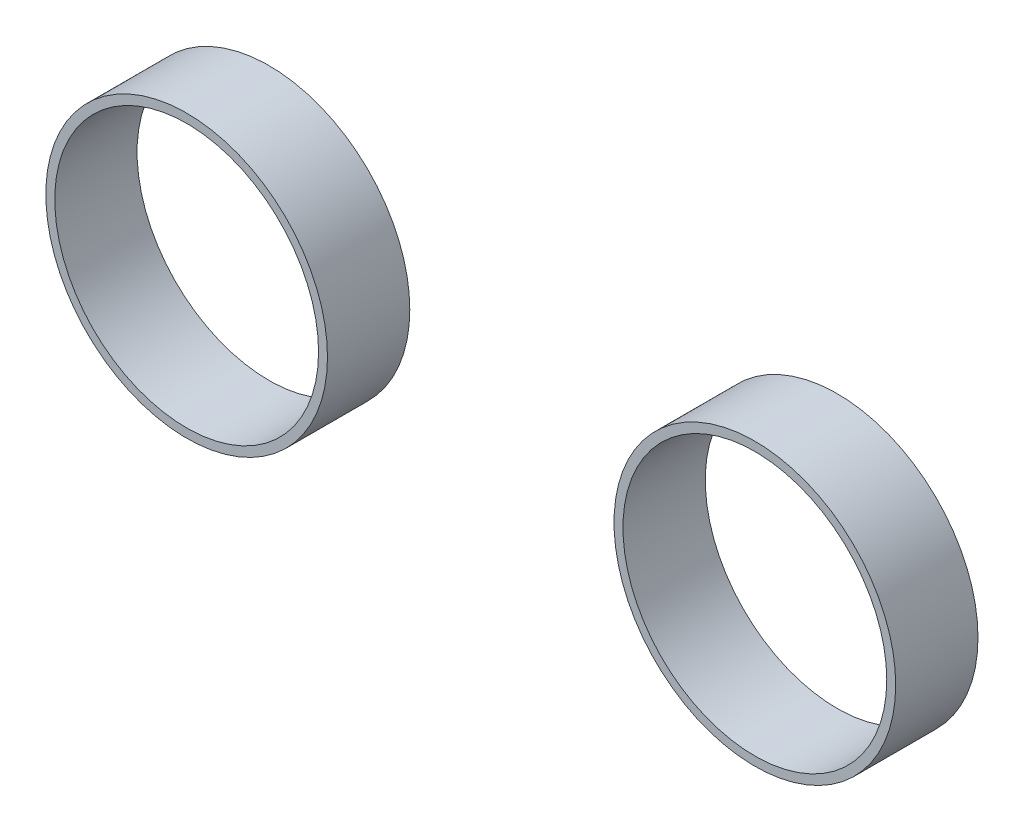
ISO-10303-21;
HEADER;
FILE_DESCRIPTION(('STEP AP214'),'2;1');
FILE_NAME('part.step','',(''),(''),'','','');
FILE_SCHEMA(('AUTOMOTIVE_DESIGN { 1 0 10303 214 1 1 1 1 }'));
ENDSEC;
DATA;
#1=APPLICATION_CONTEXT('core data for automotive mechanical design processes');
#2=APPLICATION_PROTOCOL_DEFINITION('international standard','automotive_design',2000,#1);
#3=PRODUCT_CONTEXT('',#1,'mechanical');
#4=PRODUCT('Part','Part','',(#3));
#5=PRODUCT_RELATED_PRODUCT_CATEGORY('part','',(#4));
#6=PRODUCT_DEFINITION_FORMATION('','',#4);
#7=PRODUCT_DEFINITION_CONTEXT('part definition',#1,'design');
#8=PRODUCT_DEFINITION('design','',#6,#7);
#9=PRODUCT_DEFINITION_SHAPE('','',#8);
#10=(LENGTH_UNIT() NAMED_UNIT(*) SI_UNIT(.MILLI.,.METRE.));
#11=(NAMED_UNIT(*) PLANE_ANGLE_UNIT() SI_UNIT($,.RADIAN.));
#12=(NAMED_UNIT(*) SI_UNIT($,.STERADIAN.) SOLID_ANGLE_UNIT());
#13=UNCERTAINTY_MEASURE_WITH_UNIT(LENGTH_MEASURE(1.E-05),#10,'distance_accuracy_value','');
#14=(GEOMETRIC_REPRESENTATION_CONTEXT(3) GLOBAL_UNCERTAINTY_ASSIGNED_CONTEXT((#13)) GLOBAL_UNIT_ASSIGNED_CONTEXT((#10,
#11,#12)) REPRESENTATION_CONTEXT('',''));
#15=CARTESIAN_POINT('',(0.,0.,0.));
#16=DIRECTION('',(0.,0.,1.));
#17=DIRECTION('',(1.,0.,0.));
#18=AXIS2_PLACEMENT_3D('',#15,#16,#17);
#19=CARTESIAN_POINT('',(1435.9804727587,-423.382336201578,-40.56));
#20=DIRECTION('',(0.,0.,1.));
#21=DIRECTION('',(1.,0.,0.));
#22=AXIS2_PLACEMENT_3D('',#19,#20,#21);
#23=CYLINDRICAL_SURFACE('',#22,69.3999999999999);
#24=CARTESIAN_POINT('',(1435.9804727587,-423.382336201578,-40.56));
#25=DIRECTION('',(0.,0.,1.));
#26=DIRECTION('',(1.,0.,0.));
#27=AXIS2_PLACEMENT_3D('',#24,#25,#26);
#28=CIRCLE('',#27,69.3999999999999);
#29=CARTESIAN_POINT('',(1505.3804727587,-423.382336201578,-40.56));
#30=VERTEX_POINT('',#29);
#31=EDGE_CURVE('E58',#30,#30,#28,.T.);
#32=ORIENTED_EDGE('',*,*,#31,.T.);
#33=EDGE_LOOP('',(#32));
#34=FACE_BOUND('',#33,.T.);
#35=CARTESIAN_POINT('',(1435.9804727587,-423.382336201578,0.));
#36=DIRECTION('',(0.,0.,1.));
#37=DIRECTION('',(1.,0.,0.));
#38=AXIS2_PLACEMENT_3D('',#35,#36,#37);
#39=CIRCLE('',#38,69.3999999999999);
#40=CARTESIAN_POINT('',(1505.3804727587,-423.382336201578,0.));
#41=VERTEX_POINT('',#40);
#42=EDGE_CURVE('E56',#41,#41,#39,.T.);
#43=ORIENTED_EDGE('',*,*,#42,.F.);
#44=EDGE_LOOP('',(#43));
#45=FACE_BOUND('',#44,.T.);
#46=ADVANCED_FACE('F45',(#34,#45),#23,.T.);
#47=CARTESIAN_POINT('',(1435.9804727587,-423.382336201578,-40.56));
#48=DIRECTION('',(0.,0.,1.));
#49=DIRECTION('',(1.,0.,0.));
#50=AXIS2_PLACEMENT_3D('',#47,#48,#49);
#51=PLANE('',#50);
#52=CARTESIAN_POINT('',(1435.9804727587,-423.382336201578,-40.56));
#53=DIRECTION('',(0.,0.,1.));
#54=DIRECTION('',(1.,0.,0.));
#55=AXIS2_PLACEMENT_3D('',#52,#53,#54);
#56=CIRCLE('',#55,64.9999999999999);
#57=CARTESIAN_POINT('',(1500.9804727587,-423.382336201578,-40.56));
#58=VERTEX_POINT('',#57);
#59=EDGE_CURVE('E49',#58,#58,#56,.T.);
#60=ORIENTED_EDGE('',*,*,#59,.T.);
#61=EDGE_LOOP('',(#60));
#62=FACE_BOUND('',#61,.T.);
#63=ORIENTED_EDGE('',*,*,#31,.F.);
#64=EDGE_LOOP('',(#63));
#65=FACE_BOUND('',#64,.T.);
#66=ADVANCED_FACE('F67',(#62,#65),#51,.F.);
#67=CARTESIAN_POINT('',(1435.9804727587,-423.382336201578,0.));
#68=DIRECTION('',(0.,0.,1.));
#69=DIRECTION('',(1.,0.,0.));
#70=AXIS2_PLACEMENT_3D('',#67,#68,#69);
#71=PLANE('',#70);
#72=CARTESIAN_POINT('',(1435.9804727587,-423.382336201578,0.));
#73=DIRECTION('',(0.,0.,1.));
#74=DIRECTION('',(1.,0.,0.));
#75=AXIS2_PLACEMENT_3D('',#72,#73,#74);
#76=CIRCLE('',#75,64.9999999999999);
#77=CARTESIAN_POINT('',(1500.9804727587,-423.382336201578,0.));
#78=VERTEX_POINT('',#77);
#79=EDGE_CURVE('E11',#78,#78,#76,.T.);
#80=ORIENTED_EDGE('',*,*,#79,.F.);
#81=EDGE_LOOP('',(#80));
#82=FACE_BOUND('',#81,.T.);
#83=ORIENTED_EDGE('',*,*,#42,.T.);
#84=EDGE_LOOP('',(#83));
#85=FACE_BOUND('',#84,.T.);
#86=ADVANCED_FACE('F64',(#82,#85),#71,.T.);
#87=CARTESIAN_POINT('',(1435.9804727587,-423.382336201578,-40.56));
#88=DIRECTION('',(0.,0.,1.));
#89=DIRECTION('',(1.,0.,0.));
#90=AXIS2_PLACEMENT_3D('',#87,#88,#89);
#91=CYLINDRICAL_SURFACE('',#90,64.9999999999999);
#92=ORIENTED_EDGE('',*,*,#59,.F.);
#93=EDGE_LOOP('',(#92));
#94=FACE_BOUND('',#93,.T.);
#95=ORIENTED_EDGE('',*,*,#79,.T.);
#96=EDGE_LOOP('',(#95));
#97=FACE_BOUND('',#96,.T.);
#98=ADVANCED_FACE('F47',(#94,#97),#91,.F.);
#99=CLOSED_SHELL('',(#46,#66,#86,#98));
#100=MANIFOLD_SOLID_BREP('B2',#99);
#101=CARTESIAN_POINT('',(1715.9804727587,-423.382336201567,-40.56));
#102=DIRECTION('',(0.,0.,1.));
#103=DIRECTION('',(1.,0.,0.));
#104=AXIS2_PLACEMENT_3D('',#101,#102,#103);
#105=CYLINDRICAL_SURFACE('',#104,69.3999999999999);
#106=CARTESIAN_POINT('',(1715.9804727587,-423.382336201567,-40.56));
#107=DIRECTION('',(0.,0.,1.));
#108=DIRECTION('',(1.,0.,0.));
#109=AXIS2_PLACEMENT_3D('',#106,#107,#108);
#110=CIRCLE('',#109,69.3999999999999);
#111=CARTESIAN_POINT('',(1785.3804727587,-423.382336201567,-40.56));
#112=VERTEX_POINT('',#111);
#113=EDGE_CURVE('E44',#112,#112,#110,.T.);
#114=ORIENTED_EDGE('',*,*,#113,.T.);
#115=EDGE_LOOP('',(#114));
#116=FACE_BOUND('',#115,.T.);
#117=CARTESIAN_POINT('',(1715.9804727587,-423.382336201567,0.));
#118=DIRECTION('',(0.,0.,1.));
#119=DIRECTION('',(1.,0.,0.));
#120=AXIS2_PLACEMENT_3D('',#117,#118,#119);
#121=CIRCLE('',#120,69.3999999999999);
#122=CARTESIAN_POINT('',(1785.3804727587,-423.382336201567,0.));
#123=VERTEX_POINT('',#122);
#124=EDGE_CURVE('E110',#123,#123,#121,.T.);
#125=ORIENTED_EDGE('',*,*,#124,.F.);
#126=EDGE_LOOP('',(#125));
#127=FACE_BOUND('',#126,.T.);
#128=ADVANCED_FACE('F107',(#116,#127),#105,.T.);
#129=CARTESIAN_POINT('',(1715.9804727587,-423.382336201567,-40.56));
#130=DIRECTION('',(0.,0.,1.));
#131=DIRECTION('',(1.,0.,0.));
#132=AXIS2_PLACEMENT_3D('',#129,#130,#131);
#133=PLANE('',#132);
#134=CARTESIAN_POINT('',(1715.9804727587,-423.382336201567,-40.56));
#135=DIRECTION('',(0.,0.,1.));
#136=DIRECTION('',(1.,0.,0.));
#137=AXIS2_PLACEMENT_3D('',#134,#135,#136);
#138=CIRCLE('',#137,64.9999999999999);
#139=CARTESIAN_POINT('',(1780.9804727587,-423.382336201567,-40.56));
#140=VERTEX_POINT('',#139);
#141=EDGE_CURVE('E117',#140,#140,#138,.T.);
#142=ORIENTED_EDGE('',*,*,#141,.T.);
#143=EDGE_LOOP('',(#142));
#144=FACE_BOUND('',#143,.T.);
#145=ORIENTED_EDGE('',*,*,#113,.F.);
#146=EDGE_LOOP('',(#145));
#147=FACE_BOUND('',#146,.T.);
#148=ADVANCED_FACE('F125',(#144,#147),#133,.F.);
#149=CARTESIAN_POINT('',(1715.9804727587,-423.382336201567,0.));
#150=DIRECTION('',(0.,0.,1.));
#151=DIRECTION('',(1.,0.,0.));
#152=AXIS2_PLACEMENT_3D('',#149,#150,#151);
#153=PLANE('',#152);
#154=CARTESIAN_POINT('',(1715.9804727587,-423.382336201567,0.));
#155=DIRECTION('',(0.,0.,1.));
#156=DIRECTION('',(1.,0.,0.));
#157=AXIS2_PLACEMENT_3D('',#154,#155,#156);
#158=CIRCLE('',#157,64.9999999999999);
#159=CARTESIAN_POINT('',(1780.9804727587,-423.382336201567,0.));
#160=VERTEX_POINT('',#159);
#161=EDGE_CURVE('E119',#160,#160,#158,.T.);
#162=ORIENTED_EDGE('',*,*,#161,.F.);
#163=EDGE_LOOP('',(#162));
#164=FACE_BOUND('',#163,.T.);
#165=ORIENTED_EDGE('',*,*,#124,.T.);
#166=EDGE_LOOP('',(#165));
#167=FACE_BOUND('',#166,.T.);
#168=ADVANCED_FACE('F131',(#164,#167),#153,.T.);
#169=CARTESIAN_POINT('',(1715.9804727587,-423.382336201567,-40.56));
#170=DIRECTION('',(0.,0.,1.));
#171=DIRECTION('',(1.,0.,0.));
#172=AXIS2_PLACEMENT_3D('',#169,#170,#171);
#173=CYLINDRICAL_SURFACE('',#172,64.9999999999999);
#174=ORIENTED_EDGE('',*,*,#141,.F.);
#175=EDGE_LOOP('',(#174));
#176=FACE_BOUND('',#175,.T.);
#177=ORIENTED_EDGE('',*,*,#161,.T.);
#178=EDGE_LOOP('',(#177));
#179=FACE_BOUND('',#178,.T.);
#180=ADVANCED_FACE('F128',(#176,#179),#173,.F.);
#181=CLOSED_SHELL('',(#128,#148,#168,#180));
#182=MANIFOLD_SOLID_BREP('B6',#181);
#183=ADVANCED_BREP_SHAPE_REPRESENTATION('',(#18,#100,#182),#14);
#184=SHAPE_DEFINITION_REPRESENTATION(#9,#183);
ENDSEC;
END-ISO-10303-21;
